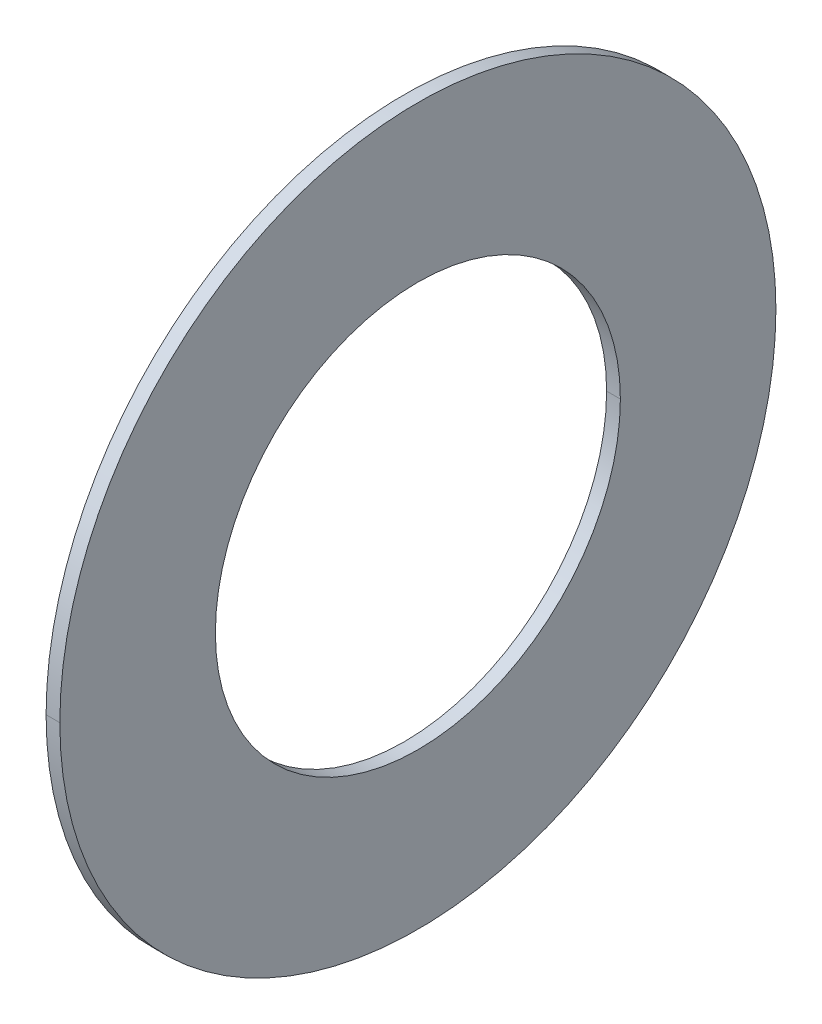
ISO-10303-21;
HEADER;
FILE_DESCRIPTION(('STEP AP214'),'2;1');
FILE_NAME('part.step','',(''),(''),'','','');
FILE_SCHEMA(('AUTOMOTIVE_DESIGN { 1 0 10303 214 1 1 1 1 }'));
ENDSEC;
DATA;
#1=APPLICATION_CONTEXT('core data for automotive mechanical design processes');
#2=APPLICATION_PROTOCOL_DEFINITION('international standard','automotive_design',2000,#1);
#3=PRODUCT_CONTEXT('',#1,'mechanical');
#4=PRODUCT('Part','Part','',(#3));
#5=PRODUCT_RELATED_PRODUCT_CATEGORY('part','',(#4));
#6=PRODUCT_DEFINITION_FORMATION('','',#4);
#7=PRODUCT_DEFINITION_CONTEXT('part definition',#1,'design');
#8=PRODUCT_DEFINITION('design','',#6,#7);
#9=PRODUCT_DEFINITION_SHAPE('','',#8);
#10=(LENGTH_UNIT() NAMED_UNIT(*) SI_UNIT(.MILLI.,.METRE.));
#11=(NAMED_UNIT(*) PLANE_ANGLE_UNIT() SI_UNIT($,.RADIAN.));
#12=(NAMED_UNIT(*) SI_UNIT($,.STERADIAN.) SOLID_ANGLE_UNIT());
#13=UNCERTAINTY_MEASURE_WITH_UNIT(LENGTH_MEASURE(1.E-05),#10,'distance_accuracy_value','');
#14=(GEOMETRIC_REPRESENTATION_CONTEXT(3) GLOBAL_UNCERTAINTY_ASSIGNED_CONTEXT((#13)) GLOBAL_UNIT_ASSIGNED_CONTEXT((#10,
#11,#12)) REPRESENTATION_CONTEXT('',''));
#15=CARTESIAN_POINT('',(0.,0.,0.));
#16=DIRECTION('',(0.,0.,1.));
#17=DIRECTION('',(1.,0.,0.));
#18=AXIS2_PLACEMENT_3D('',#15,#16,#17);
#19=CARTESIAN_POINT('',(4.6875,6.1,0.));
#20=DIRECTION('',(-1.,0.,0.));
#21=DIRECTION('',(0.,0.,1.));
#22=AXIS2_PLACEMENT_3D('',#19,#20,#21);
#23=PLANE('',#22);
#24=CARTESIAN_POINT('',(4.6875,0.,0.));
#25=DIRECTION('',(1.,0.,0.));
#26=DIRECTION('',(0.,0.,-1.));
#27=AXIS2_PLACEMENT_3D('',#24,#25,#26);
#28=CIRCLE('',#27,3.45);
#29=CARTESIAN_POINT('',(4.6875,0.,-3.45));
#30=VERTEX_POINT('',#29);
#31=CARTESIAN_POINT('',(4.6875,0.,3.45));
#32=VERTEX_POINT('',#31);
#33=EDGE_CURVE('E11',#30,#32,#28,.T.);
#34=ORIENTED_EDGE('',*,*,#33,.T.);
#35=CARTESIAN_POINT('',(4.6875,0.,0.));
#36=DIRECTION('',(1.,0.,0.));
#37=DIRECTION('',(0.,0.,-1.));
#38=AXIS2_PLACEMENT_3D('',#35,#36,#37);
#39=CIRCLE('',#38,3.45);
#40=EDGE_CURVE('E25',#32,#30,#39,.T.);
#41=ORIENTED_EDGE('',*,*,#40,.T.);
#42=EDGE_LOOP('',(#34,#41));
#43=FACE_BOUND('',#42,.T.);
#44=CARTESIAN_POINT('',(4.6875,0.,0.));
#45=DIRECTION('',(1.,0.,0.));
#46=DIRECTION('',(0.,0.,-1.));
#47=AXIS2_PLACEMENT_3D('',#44,#45,#46);
#48=CIRCLE('',#47,6.1);
#49=CARTESIAN_POINT('',(4.6875,0.,-6.1));
#50=VERTEX_POINT('',#49);
#51=CARTESIAN_POINT('',(4.6875,0.,6.1));
#52=VERTEX_POINT('',#51);
#53=EDGE_CURVE('E96',#50,#52,#48,.T.);
#54=ORIENTED_EDGE('',*,*,#53,.F.);
#55=CARTESIAN_POINT('',(4.6875,0.,0.));
#56=DIRECTION('',(1.,0.,0.));
#57=DIRECTION('',(0.,0.,-1.));
#58=AXIS2_PLACEMENT_3D('',#55,#56,#57);
#59=CIRCLE('',#58,6.1);
#60=EDGE_CURVE('E91',#52,#50,#59,.T.);
#61=ORIENTED_EDGE('',*,*,#60,.F.);
#62=EDGE_LOOP('',(#54,#61));
#63=FACE_BOUND('',#62,.T.);
#64=ADVANCED_FACE('F17',(#43,#63),#23,.T.);
#65=CARTESIAN_POINT('',(4.92175,0.,0.));
#66=DIRECTION('',(-1.,0.,0.));
#67=DIRECTION('',(0.,1.,0.));
#68=AXIS2_PLACEMENT_3D('',#65,#66,#67);
#69=CYLINDRICAL_SURFACE('',#68,6.1);
#70=ORIENTED_EDGE('',*,*,#60,.T.);
#71=DIRECTION('',(-1.,0.,0.));
#72=VECTOR('',#71,1.);
#73=CARTESIAN_POINT('',(4.92175,0.,-6.1));
#74=LINE('',#73,#72);
#75=CARTESIAN_POINT('',(4.92175,0.,-6.1));
#76=VERTEX_POINT('',#75);
#77=EDGE_CURVE('E86',#76,#50,#74,.T.);
#78=ORIENTED_EDGE('',*,*,#77,.F.);
#79=CARTESIAN_POINT('',(4.92175,0.,0.));
#80=DIRECTION('',(1.,0.,0.));
#81=DIRECTION('',(0.,0.,-1.));
#82=AXIS2_PLACEMENT_3D('',#79,#80,#81);
#83=CIRCLE('',#82,6.1);
#84=CARTESIAN_POINT('',(4.92175,0.,6.1));
#85=VERTEX_POINT('',#84);
#86=EDGE_CURVE('E81',#85,#76,#83,.T.);
#87=ORIENTED_EDGE('',*,*,#86,.F.);
#88=DIRECTION('',(-1.,0.,0.));
#89=VECTOR('',#88,1.);
#90=CARTESIAN_POINT('',(4.92175,0.,6.1));
#91=LINE('',#90,#89);
#92=EDGE_CURVE('E70',#85,#52,#91,.T.);
#93=ORIENTED_EDGE('',*,*,#92,.T.);
#94=EDGE_LOOP('',(#70,#78,#87,#93));
#95=FACE_BOUND('',#94,.T.);
#96=ADVANCED_FACE('F111',(#95),#69,.T.);
#97=CARTESIAN_POINT('',(4.92175,0.,0.));
#98=DIRECTION('',(-1.,0.,0.));
#99=DIRECTION('',(0.,-1.,0.));
#100=AXIS2_PLACEMENT_3D('',#97,#98,#99);
#101=CYLINDRICAL_SURFACE('',#100,6.1);
#102=CARTESIAN_POINT('',(4.92175,0.,0.));
#103=DIRECTION('',(1.,0.,0.));
#104=DIRECTION('',(0.,0.,-1.));
#105=AXIS2_PLACEMENT_3D('',#102,#103,#104);
#106=CIRCLE('',#105,6.1);
#107=EDGE_CURVE('E67',#76,#85,#106,.T.);
#108=ORIENTED_EDGE('',*,*,#107,.F.);
#109=ORIENTED_EDGE('',*,*,#77,.T.);
#110=ORIENTED_EDGE('',*,*,#53,.T.);
#111=ORIENTED_EDGE('',*,*,#92,.F.);
#112=EDGE_LOOP('',(#108,#109,#110,#111));
#113=FACE_BOUND('',#112,.T.);
#114=ADVANCED_FACE('F108',(#113),#101,.T.);
#115=CARTESIAN_POINT('',(4.92175,3.45,0.));
#116=DIRECTION('',(1.,0.,0.));
#117=DIRECTION('',(0.,0.,-1.));
#118=AXIS2_PLACEMENT_3D('',#115,#116,#117);
#119=PLANE('',#118);
#120=ORIENTED_EDGE('',*,*,#107,.T.);
#121=ORIENTED_EDGE('',*,*,#86,.T.);
#122=EDGE_LOOP('',(#120,#121));
#123=FACE_BOUND('',#122,.T.);
#124=CARTESIAN_POINT('',(4.92175,0.,0.));
#125=DIRECTION('',(1.,0.,0.));
#126=DIRECTION('',(0.,0.,-1.));
#127=AXIS2_PLACEMENT_3D('',#124,#125,#126);
#128=CIRCLE('',#127,3.45);
#129=CARTESIAN_POINT('',(4.92175,0.,-3.45));
#130=VERTEX_POINT('',#129);
#131=CARTESIAN_POINT('',(4.92175,0.,3.45));
#132=VERTEX_POINT('',#131);
#133=EDGE_CURVE('E56',#130,#132,#128,.T.);
#134=ORIENTED_EDGE('',*,*,#133,.F.);
#135=CARTESIAN_POINT('',(4.92175,0.,0.));
#136=DIRECTION('',(1.,0.,0.));
#137=DIRECTION('',(0.,0.,-1.));
#138=AXIS2_PLACEMENT_3D('',#135,#136,#137);
#139=CIRCLE('',#138,3.45);
#140=EDGE_CURVE('E52',#132,#130,#139,.T.);
#141=ORIENTED_EDGE('',*,*,#140,.F.);
#142=EDGE_LOOP('',(#134,#141));
#143=FACE_BOUND('',#142,.T.);
#144=ADVANCED_FACE('F54',(#123,#143),#119,.T.);
#145=CARTESIAN_POINT('',(4.92175,0.,0.));
#146=DIRECTION('',(-1.,0.,0.));
#147=DIRECTION('',(0.,1.,0.));
#148=AXIS2_PLACEMENT_3D('',#145,#146,#147);
#149=CYLINDRICAL_SURFACE('',#148,3.45);
#150=ORIENTED_EDGE('',*,*,#40,.F.);
#151=DIRECTION('',(-1.,0.,0.));
#152=VECTOR('',#151,1.);
#153=CARTESIAN_POINT('',(4.92175,0.,3.45));
#154=LINE('',#153,#152);
#155=EDGE_CURVE('E59',#132,#32,#154,.T.);
#156=ORIENTED_EDGE('',*,*,#155,.F.);
#157=ORIENTED_EDGE('',*,*,#140,.T.);
#158=DIRECTION('',(-1.,0.,0.));
#159=VECTOR('',#158,1.);
#160=CARTESIAN_POINT('',(4.92175,0.,-3.45));
#161=LINE('',#160,#159);
#162=EDGE_CURVE('E64',#130,#30,#161,.T.);
#163=ORIENTED_EDGE('',*,*,#162,.T.);
#164=EDGE_LOOP('',(#150,#156,#157,#163));
#165=FACE_BOUND('',#164,.T.);
#166=ADVANCED_FACE('F62',(#165),#149,.F.);
#167=CARTESIAN_POINT('',(4.92175,0.,0.));
#168=DIRECTION('',(-1.,0.,0.));
#169=DIRECTION('',(0.,-1.,0.));
#170=AXIS2_PLACEMENT_3D('',#167,#168,#169);
#171=CYLINDRICAL_SURFACE('',#170,3.45);
#172=ORIENTED_EDGE('',*,*,#133,.T.);
#173=ORIENTED_EDGE('',*,*,#155,.T.);
#174=ORIENTED_EDGE('',*,*,#33,.F.);
#175=ORIENTED_EDGE('',*,*,#162,.F.);
#176=EDGE_LOOP('',(#172,#173,#174,#175));
#177=FACE_BOUND('',#176,.T.);
#178=ADVANCED_FACE('F66',(#177),#171,.F.);
#179=CLOSED_SHELL('',(#64,#96,#114,#144,#166,#178));
#180=MANIFOLD_SOLID_BREP('B1',#179);
#181=ADVANCED_BREP_SHAPE_REPRESENTATION('',(#18,#180),#14);
#182=SHAPE_DEFINITION_REPRESENTATION(#9,#181);
ENDSEC;
END-ISO-10303-21;
